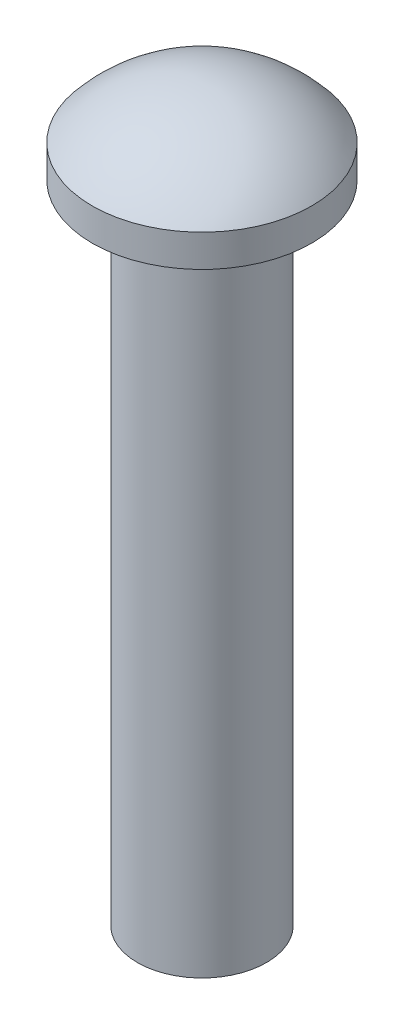
ISO-10303-21;
HEADER;
FILE_DESCRIPTION(('STEP AP214'),'2;1');
FILE_NAME('part.step','',(''),(''),'','','');
FILE_SCHEMA(('AUTOMOTIVE_DESIGN { 1 0 10303 214 1 1 1 1 }'));
ENDSEC;
DATA;
#1=APPLICATION_CONTEXT('core data for automotive mechanical design processes');
#2=APPLICATION_PROTOCOL_DEFINITION('international standard','automotive_design',2000,#1);
#3=PRODUCT_CONTEXT('',#1,'mechanical');
#4=PRODUCT('Part','Part','',(#3));
#5=PRODUCT_RELATED_PRODUCT_CATEGORY('part','',(#4));
#6=PRODUCT_DEFINITION_FORMATION('','',#4);
#7=PRODUCT_DEFINITION_CONTEXT('part definition',#1,'design');
#8=PRODUCT_DEFINITION('design','',#6,#7);
#9=PRODUCT_DEFINITION_SHAPE('','',#8);
#10=(LENGTH_UNIT() NAMED_UNIT(*) SI_UNIT(.MILLI.,.METRE.));
#11=(NAMED_UNIT(*) PLANE_ANGLE_UNIT() SI_UNIT($,.RADIAN.));
#12=(NAMED_UNIT(*) SI_UNIT($,.STERADIAN.) SOLID_ANGLE_UNIT());
#13=UNCERTAINTY_MEASURE_WITH_UNIT(LENGTH_MEASURE(1.E-05),#10,'distance_accuracy_value','');
#14=(GEOMETRIC_REPRESENTATION_CONTEXT(3) GLOBAL_UNCERTAINTY_ASSIGNED_CONTEXT((#13)) GLOBAL_UNIT_ASSIGNED_CONTEXT((#10,
#11,#12)) REPRESENTATION_CONTEXT('',''));
#15=CARTESIAN_POINT('',(0.,0.,0.));
#16=DIRECTION('',(0.,0.,1.));
#17=DIRECTION('',(1.,0.,0.));
#18=AXIS2_PLACEMENT_3D('',#15,#16,#17);
#19=CARTESIAN_POINT('',(0.,-10.,0.));
#20=DIRECTION('',(0.,-1.,0.));
#21=DIRECTION('',(0.,0.,-1.));
#22=AXIS2_PLACEMENT_3D('',#19,#20,#21);
#23=PLANE('',#22);
#24=CARTESIAN_POINT('',(0.,-10.,0.));
#25=DIRECTION('',(0.,1.,0.));
#26=DIRECTION('',(0.,0.,1.));
#27=AXIS2_PLACEMENT_3D('',#24,#25,#26);
#28=CIRCLE('',#27,0.999999999999999);
#29=CARTESIAN_POINT('',(0.,-10.,0.999999999999999));
#30=VERTEX_POINT('',#29);
#31=EDGE_CURVE('E10',#30,#30,#28,.T.);
#32=ORIENTED_EDGE('',*,*,#31,.F.);
#33=EDGE_LOOP('',(#32));
#34=FACE_BOUND('',#33,.T.);
#35=ADVANCED_FACE('F35',(#34),#23,.T.);
#36=CARTESIAN_POINT('',(0.,0.,0.));
#37=DIRECTION('',(0.,1.,0.));
#38=DIRECTION('',(0.,0.,1.));
#39=AXIS2_PLACEMENT_3D('',#36,#37,#38);
#40=CYLINDRICAL_SURFACE('',#39,1.);
#41=ORIENTED_EDGE('',*,*,#31,.T.);
#42=EDGE_LOOP('',(#41));
#43=FACE_BOUND('',#42,.T.);
#44=CARTESIAN_POINT('',(0.,0.,0.));
#45=DIRECTION('',(0.,1.,0.));
#46=DIRECTION('',(0.,0.,1.));
#47=AXIS2_PLACEMENT_3D('',#44,#45,#46);
#48=CIRCLE('',#47,1.);
#49=CARTESIAN_POINT('',(0.,0.,1.));
#50=VERTEX_POINT('',#49);
#51=EDGE_CURVE('E42',#50,#50,#48,.T.);
#52=ORIENTED_EDGE('',*,*,#51,.F.);
#53=EDGE_LOOP('',(#52));
#54=FACE_BOUND('',#53,.T.);
#55=ADVANCED_FACE('F71',(#43,#54),#40,.T.);
#56=CARTESIAN_POINT('',(-1.,0.,0.));
#57=DIRECTION('',(0.,-1.,0.));
#58=DIRECTION('',(0.,0.,-1.));
#59=AXIS2_PLACEMENT_3D('',#56,#57,#58);
#60=PLANE('',#59);
#61=ORIENTED_EDGE('',*,*,#51,.T.);
#62=EDGE_LOOP('',(#61));
#63=FACE_BOUND('',#62,.T.);
#64=CARTESIAN_POINT('',(0.,0.,0.));
#65=DIRECTION('',(0.,1.,0.));
#66=DIRECTION('',(0.,0.,1.));
#67=AXIS2_PLACEMENT_3D('',#64,#65,#66);
#68=CIRCLE('',#67,1.7);
#69=CARTESIAN_POINT('',(0.,0.,1.7));
#70=VERTEX_POINT('',#69);
#71=EDGE_CURVE('E48',#70,#70,#68,.T.);
#72=ORIENTED_EDGE('',*,*,#71,.F.);
#73=EDGE_LOOP('',(#72));
#74=FACE_BOUND('',#73,.T.);
#75=ADVANCED_FACE('F63',(#63,#74),#60,.T.);
#76=CARTESIAN_POINT('',(0.,0.,0.));
#77=DIRECTION('',(0.,1.,0.));
#78=DIRECTION('',(0.,0.,1.));
#79=AXIS2_PLACEMENT_3D('',#76,#77,#78);
#80=CYLINDRICAL_SURFACE('',#79,1.7);
#81=ORIENTED_EDGE('',*,*,#71,.T.);
#82=EDGE_LOOP('',(#81));
#83=FACE_BOUND('',#82,.T.);
#84=CARTESIAN_POINT('',(0.,0.5,0.));
#85=DIRECTION('',(0.,1.,0.));
#86=DIRECTION('',(0.,0.,1.));
#87=AXIS2_PLACEMENT_3D('',#84,#85,#86);
#88=CIRCLE('',#87,1.7);
#89=CARTESIAN_POINT('',(0.,0.5,1.7));
#90=VERTEX_POINT('',#89);
#91=EDGE_CURVE('E53',#90,#90,#88,.T.);
#92=ORIENTED_EDGE('',*,*,#91,.F.);
#93=EDGE_LOOP('',(#92));
#94=FACE_BOUND('',#93,.T.);
#95=ADVANCED_FACE('F61',(#83,#94),#80,.T.);
#96=CARTESIAN_POINT('',(0.,-0.90625,0.));
#97=DIRECTION('',(0.,1.,0.));
#98=DIRECTION('',(1.,0.,0.));
#99=AXIS2_PLACEMENT_3D('',#96,#97,#98);
#100=SPHERICAL_SURFACE('',#99,2.20625);
#101=ORIENTED_EDGE('',*,*,#91,.T.);
#102=EDGE_LOOP('',(#101));
#103=FACE_BOUND('',#102,.T.);
#104=ADVANCED_FACE('F59',(#103),#100,.T.);
#105=CLOSED_SHELL('',(#35,#55,#75,#95,#104));
#106=MANIFOLD_SOLID_BREP('B2',#105);
#107=ADVANCED_BREP_SHAPE_REPRESENTATION('',(#18,#106),#14);
#108=SHAPE_DEFINITION_REPRESENTATION(#9,#107);
ENDSEC;
END-ISO-10303-21;
